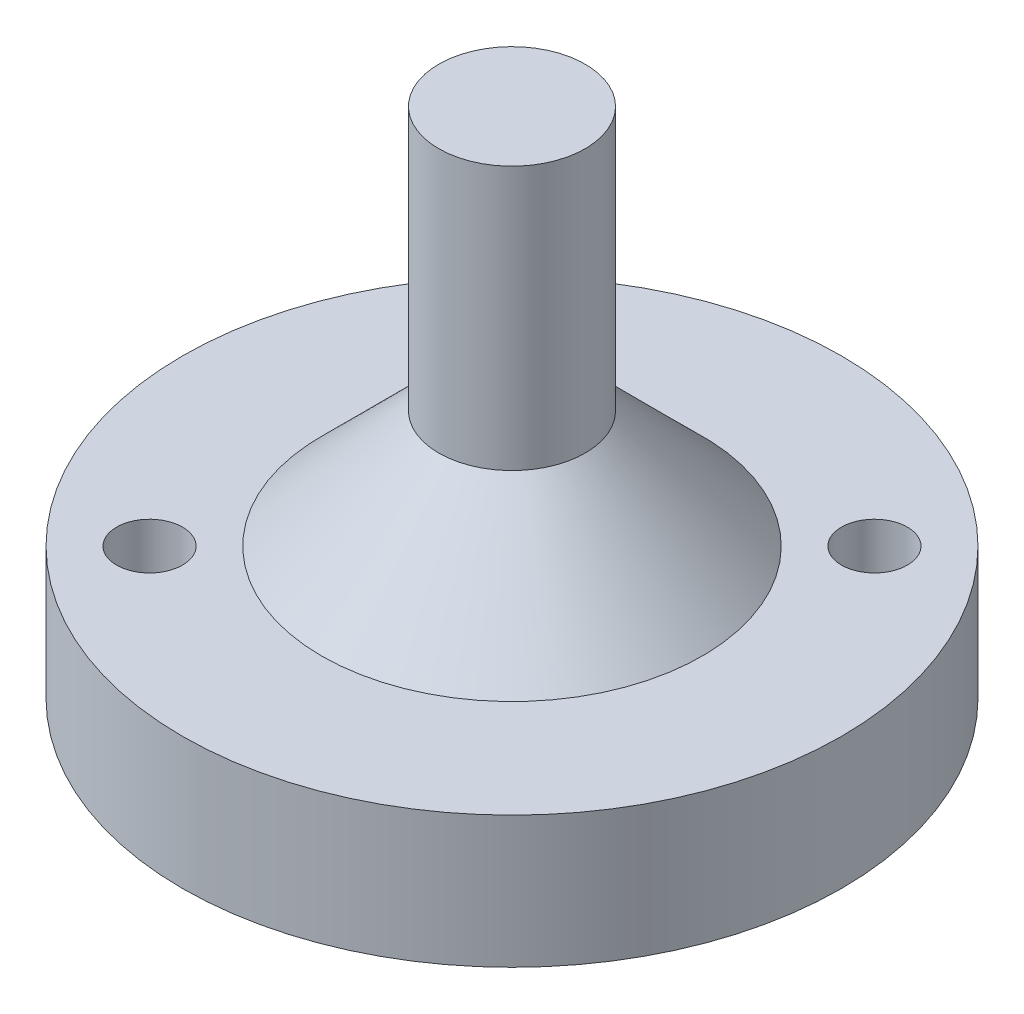
ISO-10303-21;
HEADER;
FILE_DESCRIPTION(('STEP AP214'),'2;1');
FILE_NAME('part.step','',(''),(''),'','','');
FILE_SCHEMA(('AUTOMOTIVE_DESIGN { 1 0 10303 214 1 1 1 1 }'));
ENDSEC;
DATA;
#1=APPLICATION_CONTEXT('core data for automotive mechanical design processes');
#2=APPLICATION_PROTOCOL_DEFINITION('international standard','automotive_design',2000,#1);
#3=PRODUCT_CONTEXT('',#1,'mechanical');
#4=PRODUCT('Part','Part','',(#3));
#5=PRODUCT_RELATED_PRODUCT_CATEGORY('part','',(#4));
#6=PRODUCT_DEFINITION_FORMATION('','',#4);
#7=PRODUCT_DEFINITION_CONTEXT('part definition',#1,'design');
#8=PRODUCT_DEFINITION('design','',#6,#7);
#9=PRODUCT_DEFINITION_SHAPE('','',#8);
#10=(LENGTH_UNIT() NAMED_UNIT(*) SI_UNIT(.MILLI.,.METRE.));
#11=(NAMED_UNIT(*) PLANE_ANGLE_UNIT() SI_UNIT($,.RADIAN.));
#12=(NAMED_UNIT(*) SI_UNIT($,.STERADIAN.) SOLID_ANGLE_UNIT());
#13=UNCERTAINTY_MEASURE_WITH_UNIT(LENGTH_MEASURE(1.E-05),#10,'distance_accuracy_value','');
#14=(GEOMETRIC_REPRESENTATION_CONTEXT(3) GLOBAL_UNCERTAINTY_ASSIGNED_CONTEXT((#13)) GLOBAL_UNIT_ASSIGNED_CONTEXT((#10,
#11,#12)) REPRESENTATION_CONTEXT('',''));
#15=CARTESIAN_POINT('',(0.,0.,0.));
#16=DIRECTION('',(0.,0.,1.));
#17=DIRECTION('',(1.,0.,0.));
#18=AXIS2_PLACEMENT_3D('',#15,#16,#17);
#19=CARTESIAN_POINT('',(0.,9.,0.));
#20=DIRECTION('',(0.,-1.,0.));
#21=DIRECTION('',(0.,0.,-1.));
#22=AXIS2_PLACEMENT_3D('',#19,#20,#21);
#23=CYLINDRICAL_SURFACE('',#22,22.5);
#24=CARTESIAN_POINT('',(0.,9.,0.));
#25=DIRECTION('',(0.,1.,0.));
#26=DIRECTION('',(0.,0.,1.));
#27=AXIS2_PLACEMENT_3D('',#24,#25,#26);
#28=CIRCLE('',#27,22.5);
#29=CARTESIAN_POINT('',(0.,9.,22.5));
#30=VERTEX_POINT('',#29);
#31=EDGE_CURVE('E50',#30,#30,#28,.T.);
#32=ORIENTED_EDGE('',*,*,#31,.F.);
#33=EDGE_LOOP('',(#32));
#34=FACE_BOUND('',#33,.T.);
#35=CARTESIAN_POINT('',(0.,0.,0.));
#36=DIRECTION('',(0.,1.,0.));
#37=DIRECTION('',(0.,0.,1.));
#38=AXIS2_PLACEMENT_3D('',#35,#36,#37);
#39=CIRCLE('',#38,22.5);
#40=CARTESIAN_POINT('',(0.,0.,22.5));
#41=VERTEX_POINT('',#40);
#42=EDGE_CURVE('E55',#41,#41,#39,.T.);
#43=ORIENTED_EDGE('',*,*,#42,.T.);
#44=EDGE_LOOP('',(#43));
#45=FACE_BOUND('',#44,.T.);
#46=ADVANCED_FACE('F37',(#34,#45),#23,.T.);
#47=CARTESIAN_POINT('',(0.,9.,0.));
#48=DIRECTION('',(0.,1.,0.));
#49=DIRECTION('',(0.,0.,1.));
#50=AXIS2_PLACEMENT_3D('',#47,#48,#49);
#51=PLANE('',#50);
#52=CARTESIAN_POINT('',(0.,9.,0.));
#53=DIRECTION('',(0.,1.,0.));
#54=DIRECTION('',(0.,0.,1.));
#55=AXIS2_PLACEMENT_3D('',#52,#53,#54);
#56=CIRCLE('',#55,13.);
#57=CARTESIAN_POINT('',(0.,9.,13.));
#58=VERTEX_POINT('',#57);
#59=EDGE_CURVE('E10',#58,#58,#56,.F.);
#60=ORIENTED_EDGE('',*,*,#59,.T.);
#61=EDGE_LOOP('',(#60));
#62=FACE_BOUND('',#61,.T.);
#63=CARTESIAN_POINT('',(-12.3743686707646,9.,12.3743686707646));
#64=DIRECTION('',(0.,1.,0.));
#65=DIRECTION('',(0.,0.,-1.));
#66=AXIS2_PLACEMENT_3D('',#63,#64,#65);
#67=CIRCLE('',#66,2.25);
#68=CARTESIAN_POINT('',(-12.3743686707646,9.,10.1243686707646));
#69=VERTEX_POINT('',#68);
#70=EDGE_CURVE('E70',#69,#69,#67,.T.);
#71=ORIENTED_EDGE('',*,*,#70,.F.);
#72=EDGE_LOOP('',(#71));
#73=FACE_BOUND('',#72,.T.);
#74=CARTESIAN_POINT('',(12.3743686707646,9.,-12.3743686707646));
#75=DIRECTION('',(0.,1.,0.));
#76=DIRECTION('',(0.,0.,1.));
#77=AXIS2_PLACEMENT_3D('',#74,#75,#76);
#78=CIRCLE('',#77,2.25);
#79=CARTESIAN_POINT('',(12.3743686707646,9.,-10.1243686707646));
#80=VERTEX_POINT('',#79);
#81=EDGE_CURVE('E62',#80,#80,#78,.T.);
#82=ORIENTED_EDGE('',*,*,#81,.F.);
#83=EDGE_LOOP('',(#82));
#84=FACE_BOUND('',#83,.T.);
#85=ORIENTED_EDGE('',*,*,#31,.T.);
#86=EDGE_LOOP('',(#85));
#87=FACE_BOUND('',#86,.T.);
#88=ADVANCED_FACE('F102',(#62,#73,#84,#87),#51,.T.);
#89=CARTESIAN_POINT('',(0.,0.,0.));
#90=DIRECTION('',(0.,1.,0.));
#91=DIRECTION('',(0.,0.,1.));
#92=AXIS2_PLACEMENT_3D('',#89,#90,#91);
#93=PLANE('',#92);
#94=CARTESIAN_POINT('',(0.,0.,0.));
#95=DIRECTION('',(0.,-1.,0.));
#96=DIRECTION('',(0.,0.,-1.));
#97=AXIS2_PLACEMENT_3D('',#94,#95,#96);
#98=CIRCLE('',#97,9.25);
#99=CARTESIAN_POINT('',(0.,0.,-9.25));
#100=VERTEX_POINT('',#99);
#101=EDGE_CURVE('E82',#100,#100,#98,.T.);
#102=ORIENTED_EDGE('',*,*,#101,.F.);
#103=EDGE_LOOP('',(#102));
#104=FACE_BOUND('',#103,.T.);
#105=CARTESIAN_POINT('',(-12.3743686707646,0.,12.3743686707646));
#106=DIRECTION('',(0.,1.,0.));
#107=DIRECTION('',(0.,0.,-1.));
#108=AXIS2_PLACEMENT_3D('',#105,#106,#107);
#109=CIRCLE('',#108,2.25);
#110=CARTESIAN_POINT('',(-12.3743686707646,0.,10.1243686707646));
#111=VERTEX_POINT('',#110);
#112=EDGE_CURVE('E66',#111,#111,#109,.T.);
#113=ORIENTED_EDGE('',*,*,#112,.T.);
#114=EDGE_LOOP('',(#113));
#115=FACE_BOUND('',#114,.T.);
#116=CARTESIAN_POINT('',(12.3743686707646,0.,-12.3743686707646));
#117=DIRECTION('',(0.,1.,0.));
#118=DIRECTION('',(0.,0.,1.));
#119=AXIS2_PLACEMENT_3D('',#116,#117,#118);
#120=CIRCLE('',#119,2.25);
#121=CARTESIAN_POINT('',(12.3743686707646,0.,-10.1243686707646));
#122=VERTEX_POINT('',#121);
#123=EDGE_CURVE('E60',#122,#122,#120,.T.);
#124=ORIENTED_EDGE('',*,*,#123,.T.);
#125=EDGE_LOOP('',(#124));
#126=FACE_BOUND('',#125,.T.);
#127=ORIENTED_EDGE('',*,*,#42,.F.);
#128=EDGE_LOOP('',(#127));
#129=FACE_BOUND('',#128,.T.);
#130=ADVANCED_FACE('F98',(#104,#115,#126,#129),#93,.F.);
#131=CARTESIAN_POINT('',(12.3743686707646,0.,-12.3743686707646));
#132=DIRECTION('',(0.,1.,0.));
#133=DIRECTION('',(0.,0.,1.));
#134=AXIS2_PLACEMENT_3D('',#131,#132,#133);
#135=CYLINDRICAL_SURFACE('',#134,2.25);
#136=ORIENTED_EDGE('',*,*,#123,.F.);
#137=EDGE_LOOP('',(#136));
#138=FACE_BOUND('',#137,.T.);
#139=ORIENTED_EDGE('',*,*,#81,.T.);
#140=EDGE_LOOP('',(#139));
#141=FACE_BOUND('',#140,.T.);
#142=ADVANCED_FACE('F101',(#138,#141),#135,.F.);
#143=CARTESIAN_POINT('',(-12.3743686707646,0.,12.3743686707646));
#144=DIRECTION('',(0.,1.,0.));
#145=DIRECTION('',(0.,0.,1.));
#146=AXIS2_PLACEMENT_3D('',#143,#144,#145);
#147=CYLINDRICAL_SURFACE('',#146,2.25);
#148=ORIENTED_EDGE('',*,*,#112,.F.);
#149=EDGE_LOOP('',(#148));
#150=FACE_BOUND('',#149,.T.);
#151=ORIENTED_EDGE('',*,*,#70,.T.);
#152=EDGE_LOOP('',(#151));
#153=FACE_BOUND('',#152,.T.);
#154=ADVANCED_FACE('F120',(#150,#153),#147,.F.);
#155=CARTESIAN_POINT('',(0.,35.,0.));
#156=DIRECTION('',(0.,-1.,0.));
#157=DIRECTION('',(0.,0.,-1.));
#158=AXIS2_PLACEMENT_3D('',#155,#156,#157);
#159=CYLINDRICAL_SURFACE('',#158,5.);
#160=CARTESIAN_POINT('',(0.,17.0000000000001,0.));
#161=DIRECTION('',(0.,1.,0.));
#162=DIRECTION('',(0.,0.,1.));
#163=AXIS2_PLACEMENT_3D('',#160,#161,#162);
#164=CIRCLE('',#163,5.);
#165=CARTESIAN_POINT('',(0.,17.0000000000001,5.));
#166=VERTEX_POINT('',#165);
#167=EDGE_CURVE('E45',#166,#166,#164,.T.);
#168=ORIENTED_EDGE('',*,*,#167,.T.);
#169=EDGE_LOOP('',(#168));
#170=FACE_BOUND('',#169,.T.);
#171=CARTESIAN_POINT('',(0.,35.,0.));
#172=DIRECTION('',(0.,1.,0.));
#173=DIRECTION('',(0.,0.,1.));
#174=AXIS2_PLACEMENT_3D('',#171,#172,#173);
#175=CIRCLE('',#174,5.);
#176=CARTESIAN_POINT('',(0.,35.,5.));
#177=VERTEX_POINT('',#176);
#178=EDGE_CURVE('E74',#177,#177,#175,.T.);
#179=ORIENTED_EDGE('',*,*,#178,.F.);
#180=EDGE_LOOP('',(#179));
#181=FACE_BOUND('',#180,.T.);
#182=ADVANCED_FACE('F124',(#170,#181),#159,.T.);
#183=CARTESIAN_POINT('',(0.,35.,0.));
#184=DIRECTION('',(0.,1.,0.));
#185=DIRECTION('',(0.,0.,1.));
#186=AXIS2_PLACEMENT_3D('',#183,#184,#185);
#187=PLANE('',#186);
#188=ORIENTED_EDGE('',*,*,#178,.T.);
#189=EDGE_LOOP('',(#188));
#190=FACE_BOUND('',#189,.T.);
#191=ADVANCED_FACE('F128',(#190),#187,.T.);
#192=CARTESIAN_POINT('',(0.,17.0000000000001,0.));
#193=DIRECTION('',(0.,-1.,0.));
#194=DIRECTION('',(0.,0.,-1.));
#195=AXIS2_PLACEMENT_3D('',#192,#193,#194);
#196=CONICAL_SURFACE('',#195,5.,0.785398163397444);
#197=ORIENTED_EDGE('',*,*,#59,.F.);
#198=EDGE_LOOP('',(#197));
#199=FACE_BOUND('',#198,.T.);
#200=ORIENTED_EDGE('',*,*,#167,.F.);
#201=EDGE_LOOP('',(#200));
#202=FACE_BOUND('',#201,.T.);
#203=ADVANCED_FACE('F39',(#199,#202),#196,.T.);
#204=CARTESIAN_POINT('',(0.,7.,0.));
#205=DIRECTION('',(0.,-1.,0.));
#206=DIRECTION('',(0.,0.,-1.));
#207=AXIS2_PLACEMENT_3D('',#204,#205,#206);
#208=CYLINDRICAL_SURFACE('',#207,9.25);
#209=CARTESIAN_POINT('',(0.,7.,0.));
#210=DIRECTION('',(0.,-1.,0.));
#211=DIRECTION('',(0.,0.,-1.));
#212=AXIS2_PLACEMENT_3D('',#209,#210,#211);
#213=CIRCLE('',#212,9.25);
#214=CARTESIAN_POINT('',(0.,7.,-9.25));
#215=VERTEX_POINT('',#214);
#216=EDGE_CURVE('E81',#215,#215,#213,.T.);
#217=ORIENTED_EDGE('',*,*,#216,.F.);
#218=EDGE_LOOP('',(#217));
#219=FACE_BOUND('',#218,.T.);
#220=ORIENTED_EDGE('',*,*,#101,.T.);
#221=EDGE_LOOP('',(#220));
#222=FACE_BOUND('',#221,.T.);
#223=ADVANCED_FACE('F92',(#219,#222),#208,.F.);
#224=CARTESIAN_POINT('',(0.,7.,0.));
#225=DIRECTION('',(0.,-1.,0.));
#226=DIRECTION('',(0.,0.,-1.));
#227=AXIS2_PLACEMENT_3D('',#224,#225,#226);
#228=PLANE('',#227);
#229=ORIENTED_EDGE('',*,*,#216,.T.);
#230=EDGE_LOOP('',(#229));
#231=FACE_BOUND('',#230,.T.);
#232=ADVANCED_FACE('F90',(#231),#228,.T.);
#233=CLOSED_SHELL('',(#46,#88,#130,#142,#154,#182,#191,#203,#223,#232));
#234=MANIFOLD_SOLID_BREP('B2',#233);
#235=ADVANCED_BREP_SHAPE_REPRESENTATION('',(#18,#234),#14);
#236=SHAPE_DEFINITION_REPRESENTATION(#9,#235);
ENDSEC;
END-ISO-10303-21;
